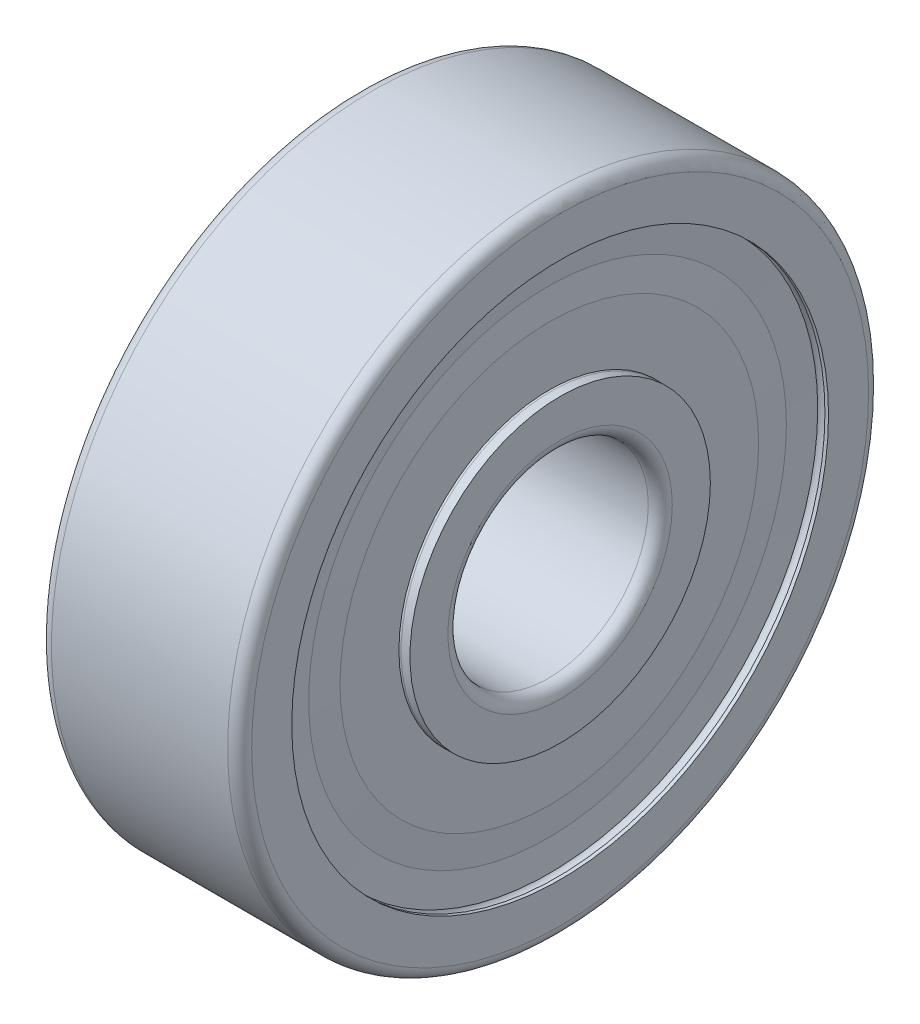
ISO-10303-21;
HEADER;
FILE_DESCRIPTION(('STEP AP214'),'2;1');
FILE_NAME('part.step','',(''),(''),'','','');
FILE_SCHEMA(('AUTOMOTIVE_DESIGN { 1 0 10303 214 1 1 1 1 }'));
ENDSEC;
DATA;
#1=APPLICATION_CONTEXT('core data for automotive mechanical design processes');
#2=APPLICATION_PROTOCOL_DEFINITION('international standard','automotive_design',2000,#1);
#3=PRODUCT_CONTEXT('',#1,'mechanical');
#4=PRODUCT('Part','Part','',(#3));
#5=PRODUCT_RELATED_PRODUCT_CATEGORY('part','',(#4));
#6=PRODUCT_DEFINITION_FORMATION('','',#4);
#7=PRODUCT_DEFINITION_CONTEXT('part definition',#1,'design');
#8=PRODUCT_DEFINITION('design','',#6,#7);
#9=PRODUCT_DEFINITION_SHAPE('','',#8);
#10=(LENGTH_UNIT() NAMED_UNIT(*) SI_UNIT(.MILLI.,.METRE.));
#11=(NAMED_UNIT(*) PLANE_ANGLE_UNIT() SI_UNIT($,.RADIAN.));
#12=(NAMED_UNIT(*) SI_UNIT($,.STERADIAN.) SOLID_ANGLE_UNIT());
#13=UNCERTAINTY_MEASURE_WITH_UNIT(LENGTH_MEASURE(1.E-05),#10,'distance_accuracy_value','');
#14=(GEOMETRIC_REPRESENTATION_CONTEXT(3) GLOBAL_UNCERTAINTY_ASSIGNED_CONTEXT((#13)) GLOBAL_UNIT_ASSIGNED_CONTEXT((#10,
#11,#12)) REPRESENTATION_CONTEXT('',''));
#15=CARTESIAN_POINT('',(0.,0.,0.));
#16=DIRECTION('',(0.,0.,1.));
#17=DIRECTION('',(1.,0.,0.));
#18=AXIS2_PLACEMENT_3D('',#15,#16,#17);
#19=CARTESIAN_POINT('',(4.778,0.,0.));
#20=DIRECTION('',(1.,0.,0.));
#21=DIRECTION('',(0.,0.,-1.));
#22=AXIS2_PLACEMENT_3D('',#19,#20,#21);
#23=TOROIDAL_SURFACE('',#22,3.972,0.222);
#24=CARTESIAN_POINT('',(4.63691261158267,0.,0.));
#25=DIRECTION('',(-1.,0.,0.));
#26=DIRECTION('',(0.,0.,1.));
#27=AXIS2_PLACEMENT_3D('',#24,#25,#26);
#28=CIRCLE('',#27,3.80059886572842);
#29=CARTESIAN_POINT('',(4.63691261158267,0.,3.80059886572842));
#30=VERTEX_POINT('',#29);
#31=EDGE_CURVE('P0_E10',#30,#30,#28,.T.);
#32=ORIENTED_EDGE('',*,*,#31,.T.);
#33=EDGE_LOOP('',(#32));
#34=FACE_BOUND('',#33,.T.);
#35=CARTESIAN_POINT('',(4.556,0.,0.));
#36=DIRECTION('',(1.,0.,0.));
#37=DIRECTION('',(0.,0.,-1.));
#38=AXIS2_PLACEMENT_3D('',#35,#36,#37);
#39=CIRCLE('',#38,3.972);
#40=CARTESIAN_POINT('',(4.556,0.,-3.972));
#41=VERTEX_POINT('',#40);
#42=EDGE_CURVE('P0_E67',#41,#41,#39,.T.);
#43=ORIENTED_EDGE('',*,*,#42,.T.);
#44=EDGE_LOOP('',(#43));
#45=FACE_BOUND('',#44,.T.);
#46=ADVANCED_FACE('P0_F14',(#34,#45),#23,.F.);
#47=CARTESIAN_POINT('',(0.222,0.,0.));
#48=DIRECTION('',(1.,0.,0.));
#49=DIRECTION('',(0.,0.,-1.));
#50=AXIS2_PLACEMENT_3D('',#47,#48,#49);
#51=TOROIDAL_SURFACE('',#50,3.972,0.222);
#52=CARTESIAN_POINT('',(0.27,0.,0.));
#53=DIRECTION('',(1.,0.,0.));
#54=DIRECTION('',(0.,0.,-1.));
#55=AXIS2_PLACEMENT_3D('',#52,#53,#54);
#56=CIRCLE('',#55,3.75525129758174);
#57=CARTESIAN_POINT('',(0.27,0.,-3.75525129758174));
#58=VERTEX_POINT('',#57);
#59=EDGE_CURVE('P0_E25',#58,#58,#56,.F.);
#60=ORIENTED_EDGE('',*,*,#59,.T.);
#61=EDGE_LOOP('',(#60));
#62=FACE_BOUND('',#61,.T.);
#63=CARTESIAN_POINT('',(0.222,0.,0.));
#64=DIRECTION('',(1.,0.,0.));
#65=DIRECTION('',(0.,0.,-1.));
#66=AXIS2_PLACEMENT_3D('',#63,#64,#65);
#67=CIRCLE('',#66,3.75);
#68=CARTESIAN_POINT('',(0.222,0.,-3.75));
#69=VERTEX_POINT('',#68);
#70=EDGE_CURVE('P0_E61',#69,#69,#67,.T.);
#71=ORIENTED_EDGE('',*,*,#70,.T.);
#72=EDGE_LOOP('',(#71));
#73=FACE_BOUND('',#72,.T.);
#74=ADVANCED_FACE('P0_F135',(#62,#73),#51,.F.);
#75=CARTESIAN_POINT('',(0.,4.15,0.));
#76=DIRECTION('',(-1.,0.,0.));
#77=DIRECTION('',(0.,0.,1.));
#78=AXIS2_PLACEMENT_3D('',#75,#76,#77);
#79=PLANE('',#78);
#80=CARTESIAN_POINT('',(0.,0.,0.));
#81=DIRECTION('',(1.,0.,0.));
#82=DIRECTION('',(0.,0.,-1.));
#83=AXIS2_PLACEMENT_3D('',#80,#81,#82);
#84=CIRCLE('',#83,2.79985);
#85=CARTESIAN_POINT('',(0.,0.,-2.79985));
#86=VERTEX_POINT('',#85);
#87=EDGE_CURVE('P0_E40',#86,#86,#84,.T.);
#88=ORIENTED_EDGE('',*,*,#87,.T.);
#89=EDGE_LOOP('',(#88));
#90=FACE_BOUND('',#89,.T.);
#91=CARTESIAN_POINT('',(0.,0.,0.));
#92=DIRECTION('',(1.,0.,0.));
#93=DIRECTION('',(0.,0.,-1.));
#94=AXIS2_PLACEMENT_3D('',#91,#92,#93);
#95=CIRCLE('',#94,3.75);
#96=CARTESIAN_POINT('',(0.,0.,-3.75));
#97=VERTEX_POINT('',#96);
#98=EDGE_CURVE('P0_E58',#97,#97,#95,.T.);
#99=ORIENTED_EDGE('',*,*,#98,.F.);
#100=EDGE_LOOP('',(#99));
#101=FACE_BOUND('',#100,.T.);
#102=ADVANCED_FACE('P0_F16',(#90,#101),#79,.T.);
#103=CARTESIAN_POINT('',(5.,2.79985,0.));
#104=DIRECTION('',(1.,0.,0.));
#105=DIRECTION('',(0.,0.,-1.));
#106=AXIS2_PLACEMENT_3D('',#103,#104,#105);
#107=PLANE('',#106);
#108=CARTESIAN_POINT('',(5.,0.,0.));
#109=DIRECTION('',(1.,0.,0.));
#110=DIRECTION('',(0.,0.,-1.));
#111=AXIS2_PLACEMENT_3D('',#108,#109,#110);
#112=CIRCLE('',#111,3.75);
#113=CARTESIAN_POINT('',(5.,0.,-3.75));
#114=VERTEX_POINT('',#113);
#115=EDGE_CURVE('P0_E73',#114,#114,#112,.T.);
#116=ORIENTED_EDGE('',*,*,#115,.T.);
#117=EDGE_LOOP('',(#116));
#118=FACE_BOUND('',#117,.T.);
#119=CARTESIAN_POINT('',(5.,0.,0.));
#120=DIRECTION('',(1.,0.,0.));
#121=DIRECTION('',(0.,0.,-1.));
#122=AXIS2_PLACEMENT_3D('',#119,#120,#121);
#123=CIRCLE('',#122,2.79985);
#124=CARTESIAN_POINT('',(5.,0.,-2.79985));
#125=VERTEX_POINT('',#124);
#126=EDGE_CURVE('P0_E49',#125,#125,#123,.T.);
#127=ORIENTED_EDGE('',*,*,#126,.F.);
#128=EDGE_LOOP('',(#127));
#129=FACE_BOUND('',#128,.T.);
#130=ADVANCED_FACE('P0_F188',(#118,#129),#107,.T.);
#131=CARTESIAN_POINT('',(0.3,0.,0.));
#132=DIRECTION('',(1.,0.,0.));
#133=DIRECTION('',(0.,0.,-1.));
#134=AXIS2_PLACEMENT_3D('',#131,#132,#133);
#135=TOROIDAL_SURFACE('',#134,2.79985,0.3);
#136=CARTESIAN_POINT('',(0.3,0.,0.));
#137=DIRECTION('',(1.,0.,0.));
#138=DIRECTION('',(0.,0.,-1.));
#139=AXIS2_PLACEMENT_3D('',#136,#137,#138);
#140=CIRCLE('',#139,2.49985);
#141=CARTESIAN_POINT('',(0.3,0.,-2.49985));
#142=VERTEX_POINT('',#141);
#143=EDGE_CURVE('P0_E43',#142,#142,#140,.T.);
#144=ORIENTED_EDGE('',*,*,#143,.T.);
#145=EDGE_LOOP('',(#144));
#146=FACE_BOUND('',#145,.T.);
#147=ORIENTED_EDGE('',*,*,#87,.F.);
#148=EDGE_LOOP('',(#147));
#149=FACE_BOUND('',#148,.T.);
#150=ADVANCED_FACE('P0_F191',(#146,#149),#135,.T.);
#151=CARTESIAN_POINT('',(50.,0.,0.));
#152=DIRECTION('',(1.,0.,0.));
#153=DIRECTION('',(0.,0.,-1.));
#154=AXIS2_PLACEMENT_3D('',#151,#152,#153);
#155=CYLINDRICAL_SURFACE('',#154,2.49985);
#156=CARTESIAN_POINT('',(4.7,0.,0.));
#157=DIRECTION('',(1.,0.,0.));
#158=DIRECTION('',(0.,0.,-1.));
#159=AXIS2_PLACEMENT_3D('',#156,#157,#158);
#160=CIRCLE('',#159,2.49985);
#161=CARTESIAN_POINT('',(4.7,0.,-2.49985));
#162=VERTEX_POINT('',#161);
#163=EDGE_CURVE('P0_E46',#162,#162,#160,.T.);
#164=ORIENTED_EDGE('',*,*,#163,.T.);
#165=EDGE_LOOP('',(#164));
#166=FACE_BOUND('',#165,.T.);
#167=ORIENTED_EDGE('',*,*,#143,.F.);
#168=EDGE_LOOP('',(#167));
#169=FACE_BOUND('',#168,.T.);
#170=ADVANCED_FACE('P0_F195',(#166,#169),#155,.F.);
#171=CARTESIAN_POINT('',(4.7,0.,0.));
#172=DIRECTION('',(1.,0.,0.));
#173=DIRECTION('',(0.,0.,-1.));
#174=AXIS2_PLACEMENT_3D('',#171,#172,#173);
#175=TOROIDAL_SURFACE('',#174,2.79985,0.3);
#176=ORIENTED_EDGE('',*,*,#126,.T.);
#177=EDGE_LOOP('',(#176));
#178=FACE_BOUND('',#177,.T.);
#179=ORIENTED_EDGE('',*,*,#163,.F.);
#180=EDGE_LOOP('',(#179));
#181=FACE_BOUND('',#180,.T.);
#182=ADVANCED_FACE('P0_F174',(#178,#181),#175,.T.);
#183=CARTESIAN_POINT('',(50.,0.,0.));
#184=DIRECTION('',(1.,0.,0.));
#185=DIRECTION('',(0.,0.,-1.));
#186=AXIS2_PLACEMENT_3D('',#183,#184,#185);
#187=CYLINDRICAL_SURFACE('',#186,3.75);
#188=ORIENTED_EDGE('',*,*,#70,.F.);
#189=EDGE_LOOP('',(#188));
#190=FACE_BOUND('',#189,.T.);
#191=ORIENTED_EDGE('',*,*,#98,.T.);
#192=EDGE_LOOP('',(#191));
#193=FACE_BOUND('',#192,.T.);
#194=ADVANCED_FACE('P0_F170',(#190,#193),#187,.T.);
#195=CARTESIAN_POINT('',(0.444,0.,0.));
#196=DIRECTION('',(1.,0.,0.));
#197=DIRECTION('',(0.,0.,-1.));
#198=AXIS2_PLACEMENT_3D('',#195,#196,#197);
#199=CIRCLE('',#198,3.972);
#200=CARTESIAN_POINT('',(0.444,0.,-3.972));
#201=VERTEX_POINT('',#200);
#202=EDGE_CURVE('P0_E64',#201,#201,#199,.T.);
#203=ORIENTED_EDGE('',*,*,#202,.F.);
#204=EDGE_LOOP('',(#203));
#205=FACE_BOUND('',#204,.T.);
#206=CARTESIAN_POINT('',(0.363087388417327,0.,0.));
#207=DIRECTION('',(1.,0.,0.));
#208=DIRECTION('',(0.,0.,-1.));
#209=AXIS2_PLACEMENT_3D('',#206,#207,#208);
#210=CIRCLE('',#209,3.80059886572843);
#211=CARTESIAN_POINT('',(0.363087388417327,0.,-3.80059886572843));
#212=VERTEX_POINT('',#211);
#213=EDGE_CURVE('P0_E29',#212,#212,#210,.T.);
#214=ORIENTED_EDGE('',*,*,#213,.T.);
#215=EDGE_LOOP('',(#214));
#216=FACE_BOUND('',#215,.T.);
#217=ADVANCED_FACE('P0_F143',(#205,#216),#51,.F.);
#218=CARTESIAN_POINT('',(0.444,3.972,0.));
#219=DIRECTION('',(1.,0.,0.));
#220=DIRECTION('',(0.,0.,-1.));
#221=AXIS2_PLACEMENT_3D('',#218,#219,#220);
#222=PLANE('',#221);
#223=CARTESIAN_POINT('',(0.444,0.,0.));
#224=DIRECTION('',(1.,0.,0.));
#225=DIRECTION('',(0.,0.,-1.));
#226=AXIS2_PLACEMENT_3D('',#223,#224,#225);
#227=CIRCLE('',#226,4.25);
#228=CARTESIAN_POINT('',(0.444,0.,-4.25));
#229=VERTEX_POINT('',#228);
#230=EDGE_CURVE('P0_E37',#229,#229,#227,.F.);
#231=ORIENTED_EDGE('',*,*,#230,.T.);
#232=EDGE_LOOP('',(#231));
#233=FACE_BOUND('',#232,.T.);
#234=ORIENTED_EDGE('',*,*,#202,.T.);
#235=EDGE_LOOP('',(#234));
#236=FACE_BOUND('',#235,.T.);
#237=ADVANCED_FACE('P0_F157',(#233,#236),#222,.F.);
#238=CARTESIAN_POINT('',(4.556,5.931,0.));
#239=DIRECTION('',(-1.,0.,0.));
#240=DIRECTION('',(0.,0.,1.));
#241=AXIS2_PLACEMENT_3D('',#238,#239,#240);
#242=PLANE('',#241);
#243=ORIENTED_EDGE('',*,*,#42,.F.);
#244=EDGE_LOOP('',(#243));
#245=FACE_BOUND('',#244,.T.);
#246=CARTESIAN_POINT('',(4.556,0.,0.));
#247=DIRECTION('',(-1.,0.,0.));
#248=DIRECTION('',(0.,0.,1.));
#249=AXIS2_PLACEMENT_3D('',#246,#247,#248);
#250=CIRCLE('',#249,4.25);
#251=CARTESIAN_POINT('',(4.556,0.,4.25));
#252=VERTEX_POINT('',#251);
#253=EDGE_CURVE('P0_E34',#252,#252,#250,.F.);
#254=ORIENTED_EDGE('',*,*,#253,.T.);
#255=EDGE_LOOP('',(#254));
#256=FACE_BOUND('',#255,.T.);
#257=ADVANCED_FACE('P0_F149',(#245,#256),#242,.F.);
#258=CARTESIAN_POINT('',(4.778,0.,0.));
#259=DIRECTION('',(1.,0.,0.));
#260=DIRECTION('',(0.,0.,-1.));
#261=AXIS2_PLACEMENT_3D('',#258,#259,#260);
#262=CIRCLE('',#261,3.75);
#263=CARTESIAN_POINT('',(4.778,0.,-3.75));
#264=VERTEX_POINT('',#263);
#265=EDGE_CURVE('P0_E70',#264,#264,#262,.T.);
#266=ORIENTED_EDGE('',*,*,#265,.F.);
#267=EDGE_LOOP('',(#266));
#268=FACE_BOUND('',#267,.T.);
#269=CARTESIAN_POINT('',(4.73,0.,0.));
#270=DIRECTION('',(-1.,0.,0.));
#271=DIRECTION('',(0.,0.,1.));
#272=AXIS2_PLACEMENT_3D('',#269,#270,#271);
#273=CIRCLE('',#272,3.75525129758174);
#274=CARTESIAN_POINT('',(4.73,0.,3.75525129758174));
#275=VERTEX_POINT('',#274);
#276=EDGE_CURVE('P0_E21',#275,#275,#273,.F.);
#277=ORIENTED_EDGE('',*,*,#276,.T.);
#278=EDGE_LOOP('',(#277));
#279=FACE_BOUND('',#278,.T.);
#280=ADVANCED_FACE('P0_F137',(#268,#279),#23,.F.);
#281=CARTESIAN_POINT('',(50.,0.,0.));
#282=DIRECTION('',(1.,0.,0.));
#283=DIRECTION('',(0.,0.,-1.));
#284=AXIS2_PLACEMENT_3D('',#281,#282,#283);
#285=CYLINDRICAL_SURFACE('',#284,3.75);
#286=ORIENTED_EDGE('',*,*,#115,.F.);
#287=EDGE_LOOP('',(#286));
#288=FACE_BOUND('',#287,.T.);
#289=ORIENTED_EDGE('',*,*,#265,.T.);
#290=EDGE_LOOP('',(#289));
#291=FACE_BOUND('',#290,.T.);
#292=ADVANCED_FACE('P0_F148',(#288,#291),#285,.T.);
#293=CARTESIAN_POINT('',(50.,0.,0.));
#294=DIRECTION('',(1.,0.,0.));
#295=DIRECTION('',(0.,0.,-1.));
#296=AXIS2_PLACEMENT_3D('',#293,#294,#295);
#297=CYLINDRICAL_SURFACE('',#296,4.25);
#298=CARTESIAN_POINT('',(3.46401296671777,0.,0.));
#299=DIRECTION('',(1.,0.,0.));
#300=DIRECTION('',(0.,0.,-1.));
#301=AXIS2_PLACEMENT_3D('',#298,#299,#300);
#302=CIRCLE('',#301,4.25);
#303=CARTESIAN_POINT('',(3.46401296671777,0.,-4.25));
#304=VERTEX_POINT('',#303);
#305=EDGE_CURVE('P0_E52',#304,#304,#302,.T.);
#306=ORIENTED_EDGE('',*,*,#305,.T.);
#307=EDGE_LOOP('',(#306));
#308=FACE_BOUND('',#307,.T.);
#309=ORIENTED_EDGE('',*,*,#253,.F.);
#310=EDGE_LOOP('',(#309));
#311=FACE_BOUND('',#310,.T.);
#312=ADVANCED_FACE('P0_F155',(#308,#311),#297,.T.);
#313=CARTESIAN_POINT('',(2.5,0.,0.));
#314=DIRECTION('',(1.,0.,0.));
#315=DIRECTION('',(0.,0.,-1.));
#316=AXIS2_PLACEMENT_3D('',#313,#314,#315);
#317=TOROIDAL_SURFACE('',#316,5.25,1.389);
#318=ORIENTED_EDGE('',*,*,#305,.F.);
#319=EDGE_LOOP('',(#318));
#320=FACE_BOUND('',#319,.T.);
#321=CARTESIAN_POINT('',(1.53598703328222,0.,0.));
#322=DIRECTION('',(1.,0.,0.));
#323=DIRECTION('',(0.,0.,-1.));
#324=AXIS2_PLACEMENT_3D('',#321,#322,#323);
#325=CIRCLE('',#324,4.25);
#326=CARTESIAN_POINT('',(1.53598703328222,0.,-4.25));
#327=VERTEX_POINT('',#326);
#328=EDGE_CURVE('P0_E55',#327,#327,#325,.T.);
#329=ORIENTED_EDGE('',*,*,#328,.T.);
#330=EDGE_LOOP('',(#329));
#331=FACE_BOUND('',#330,.T.);
#332=ADVANCED_FACE('P0_F180',(#320,#331),#317,.F.);
#333=CARTESIAN_POINT('',(50.,0.,0.));
#334=DIRECTION('',(1.,0.,0.));
#335=DIRECTION('',(0.,0.,-1.));
#336=AXIS2_PLACEMENT_3D('',#333,#334,#335);
#337=CYLINDRICAL_SURFACE('',#336,4.25);
#338=ORIENTED_EDGE('',*,*,#230,.F.);
#339=EDGE_LOOP('',(#338));
#340=FACE_BOUND('',#339,.T.);
#341=ORIENTED_EDGE('',*,*,#328,.F.);
#342=EDGE_LOOP('',(#341));
#343=FACE_BOUND('',#342,.T.);
#344=ADVANCED_FACE('P0_F176',(#340,#343),#337,.T.);
#345=CARTESIAN_POINT('',(0.36,0.,0.));
#346=DIRECTION('',(1.,0.,0.));
#347=DIRECTION('',(0.,0.,-1.));
#348=AXIS2_PLACEMENT_3D('',#345,#346,#347);
#349=CONICAL_SURFACE('',#348,3.75,1.50985493235548);
#350=CARTESIAN_POINT('',(0.45,0.,0.));
#351=DIRECTION('',(1.,0.,0.));
#352=DIRECTION('',(0.,0.,-1.));
#353=AXIS2_PLACEMENT_3D('',#350,#351,#352);
#354=CIRCLE('',#353,5.225);
#355=CARTESIAN_POINT('',(0.45,0.,-5.225));
#356=VERTEX_POINT('',#355);
#357=EDGE_CURVE('P0_E85',#356,#356,#354,.T.);
#358=ORIENTED_EDGE('',*,*,#357,.T.);
#359=EDGE_LOOP('',(#358));
#360=FACE_BOUND('',#359,.T.);
#361=ORIENTED_EDGE('',*,*,#213,.F.);
#362=EDGE_LOOP('',(#361));
#363=FACE_BOUND('',#362,.T.);
#364=ADVANCED_FACE('P0_F179',(#360,#363),#349,.F.);
#365=CARTESIAN_POINT('',(50.,0.,0.));
#366=DIRECTION('',(1.,0.,0.));
#367=DIRECTION('',(0.,0.,-1.));
#368=AXIS2_PLACEMENT_3D('',#365,#366,#367);
#369=CYLINDRICAL_SURFACE('',#368,6.7);
#370=CARTESIAN_POINT('',(0.27,0.,0.));
#371=DIRECTION('',(1.,0.,0.));
#372=DIRECTION('',(0.,0.,-1.));
#373=AXIS2_PLACEMENT_3D('',#370,#371,#372);
#374=CIRCLE('',#373,6.7);
#375=CARTESIAN_POINT('',(0.27,0.,-6.7));
#376=VERTEX_POINT('',#375);
#377=EDGE_CURVE('P0_E76',#376,#376,#374,.T.);
#378=ORIENTED_EDGE('',*,*,#377,.T.);
#379=EDGE_LOOP('',(#378));
#380=FACE_BOUND('',#379,.T.);
#381=CARTESIAN_POINT('',(0.36,0.,0.));
#382=DIRECTION('',(1.,0.,0.));
#383=DIRECTION('',(0.,0.,-1.));
#384=AXIS2_PLACEMENT_3D('',#381,#382,#383);
#385=CIRCLE('',#384,6.7);
#386=CARTESIAN_POINT('',(0.36,0.,-6.7));
#387=VERTEX_POINT('',#386);
#388=EDGE_CURVE('P0_E91',#387,#387,#385,.T.);
#389=ORIENTED_EDGE('',*,*,#388,.F.);
#390=EDGE_LOOP('',(#389));
#391=FACE_BOUND('',#390,.T.);
#392=ADVANCED_FACE('P0_F299',(#380,#391),#369,.T.);
#393=CARTESIAN_POINT('',(0.27,0.,0.));
#394=DIRECTION('',(-1.,0.,0.));
#395=DIRECTION('',(0.,0.,1.));
#396=AXIS2_PLACEMENT_3D('',#393,#394,#395);
#397=CONICAL_SURFACE('',#396,6.7,1.50985493235548);
#398=CARTESIAN_POINT('',(0.315,0.,0.));
#399=DIRECTION('',(1.,0.,0.));
#400=DIRECTION('',(0.,0.,-1.));
#401=AXIS2_PLACEMENT_3D('',#398,#399,#400);
#402=CIRCLE('',#401,5.9625);
#403=CARTESIAN_POINT('',(0.315,0.,-5.9625));
#404=VERTEX_POINT('',#403);
#405=EDGE_CURVE('P0_E79',#404,#404,#402,.T.);
#406=ORIENTED_EDGE('',*,*,#405,.T.);
#407=EDGE_LOOP('',(#406));
#408=FACE_BOUND('',#407,.T.);
#409=ORIENTED_EDGE('',*,*,#377,.F.);
#410=EDGE_LOOP('',(#409));
#411=FACE_BOUND('',#410,.T.);
#412=ADVANCED_FACE('P0_F310',(#408,#411),#397,.F.);
#413=CARTESIAN_POINT('',(0.315,0.,0.));
#414=DIRECTION('',(1.,0.,0.));
#415=DIRECTION('',(0.,0.,-1.));
#416=AXIS2_PLACEMENT_3D('',#413,#414,#415);
#417=CONICAL_SURFACE('',#416,5.9625,1.50985493235548);
#418=CARTESIAN_POINT('',(0.27,0.,0.));
#419=DIRECTION('',(1.,0.,0.));
#420=DIRECTION('',(0.,0.,-1.));
#421=AXIS2_PLACEMENT_3D('',#418,#419,#420);
#422=CIRCLE('',#421,5.225);
#423=CARTESIAN_POINT('',(0.27,0.,-5.225));
#424=VERTEX_POINT('',#423);
#425=EDGE_CURVE('P0_E82',#424,#424,#422,.T.);
#426=ORIENTED_EDGE('',*,*,#425,.T.);
#427=EDGE_LOOP('',(#426));
#428=FACE_BOUND('',#427,.T.);
#429=ORIENTED_EDGE('',*,*,#405,.F.);
#430=EDGE_LOOP('',(#429));
#431=FACE_BOUND('',#430,.T.);
#432=ADVANCED_FACE('P0_F320',(#428,#431),#417,.T.);
#433=CARTESIAN_POINT('',(0.27,5.225,0.));
#434=DIRECTION('',(-1.,0.,0.));
#435=DIRECTION('',(0.,0.,1.));
#436=AXIS2_PLACEMENT_3D('',#433,#434,#435);
#437=PLANE('',#436);
#438=ORIENTED_EDGE('',*,*,#59,.F.);
#439=EDGE_LOOP('',(#438));
#440=FACE_BOUND('',#439,.T.);
#441=ORIENTED_EDGE('',*,*,#425,.F.);
#442=EDGE_LOOP('',(#441));
#443=FACE_BOUND('',#442,.T.);
#444=ADVANCED_FACE('P0_F330',(#440,#443),#437,.T.);
#445=CARTESIAN_POINT('',(0.45,5.225,0.));
#446=DIRECTION('',(1.,0.,0.));
#447=DIRECTION('',(0.,0.,-1.));
#448=AXIS2_PLACEMENT_3D('',#445,#446,#447);
#449=PLANE('',#448);
#450=CARTESIAN_POINT('',(0.45,0.,0.));
#451=DIRECTION('',(1.,0.,0.));
#452=DIRECTION('',(0.,0.,-1.));
#453=AXIS2_PLACEMENT_3D('',#450,#451,#452);
#454=CIRCLE('',#453,5.9625);
#455=CARTESIAN_POINT('',(0.45,0.,-5.9625));
#456=VERTEX_POINT('',#455);
#457=EDGE_CURVE('P0_E88',#456,#456,#454,.T.);
#458=ORIENTED_EDGE('',*,*,#457,.T.);
#459=EDGE_LOOP('',(#458));
#460=FACE_BOUND('',#459,.T.);
#461=ORIENTED_EDGE('',*,*,#357,.F.);
#462=EDGE_LOOP('',(#461));
#463=FACE_BOUND('',#462,.T.);
#464=ADVANCED_FACE('P0_F340',(#460,#463),#449,.T.);
#465=CARTESIAN_POINT('',(0.45,0.,0.));
#466=DIRECTION('',(-1.,0.,0.));
#467=DIRECTION('',(0.,0.,1.));
#468=AXIS2_PLACEMENT_3D('',#465,#466,#467);
#469=CONICAL_SURFACE('',#468,5.9625,1.4493628598292);
#470=ORIENTED_EDGE('',*,*,#388,.T.);
#471=EDGE_LOOP('',(#470));
#472=FACE_BOUND('',#471,.T.);
#473=ORIENTED_EDGE('',*,*,#457,.F.);
#474=EDGE_LOOP('',(#473));
#475=FACE_BOUND('',#474,.T.);
#476=ADVANCED_FACE('P0_F130',(#472,#475),#469,.T.);
#477=CARTESIAN_POINT('',(4.55,0.,0.));
#478=DIRECTION('',(-1.,0.,0.));
#479=DIRECTION('',(0.,0.,1.));
#480=AXIS2_PLACEMENT_3D('',#477,#478,#479);
#481=CONICAL_SURFACE('',#480,5.225,1.50985493235548);
#482=ORIENTED_EDGE('',*,*,#31,.F.);
#483=EDGE_LOOP('',(#482));
#484=FACE_BOUND('',#483,.T.);
#485=CARTESIAN_POINT('',(4.55,0.,0.));
#486=DIRECTION('',(1.,0.,0.));
#487=DIRECTION('',(0.,0.,-1.));
#488=AXIS2_PLACEMENT_3D('',#485,#486,#487);
#489=CIRCLE('',#488,5.225);
#490=CARTESIAN_POINT('',(4.55,0.,-5.225));
#491=VERTEX_POINT('',#490);
#492=EDGE_CURVE('P0_E97',#491,#491,#489,.T.);
#493=ORIENTED_EDGE('',*,*,#492,.F.);
#494=EDGE_LOOP('',(#493));
#495=FACE_BOUND('',#494,.T.);
#496=ADVANCED_FACE('P0_F119',(#484,#495),#481,.F.);
#497=CARTESIAN_POINT('',(4.64,0.,0.));
#498=DIRECTION('',(1.,0.,0.));
#499=DIRECTION('',(0.,0.,-1.));
#500=AXIS2_PLACEMENT_3D('',#497,#498,#499);
#501=CONICAL_SURFACE('',#500,6.7,1.4493628598292);
#502=CARTESIAN_POINT('',(4.55,0.,0.));
#503=DIRECTION('',(1.,0.,0.));
#504=DIRECTION('',(0.,0.,-1.));
#505=AXIS2_PLACEMENT_3D('',#502,#503,#504);
#506=CIRCLE('',#505,5.9625);
#507=CARTESIAN_POINT('',(4.55,0.,-5.9625));
#508=VERTEX_POINT('',#507);
#509=EDGE_CURVE('P0_E94',#508,#508,#506,.T.);
#510=ORIENTED_EDGE('',*,*,#509,.T.);
#511=EDGE_LOOP('',(#510));
#512=FACE_BOUND('',#511,.T.);
#513=CARTESIAN_POINT('',(4.64,0.,0.));
#514=DIRECTION('',(1.,0.,0.));
#515=DIRECTION('',(0.,0.,-1.));
#516=AXIS2_PLACEMENT_3D('',#513,#514,#515);
#517=CIRCLE('',#516,6.7);
#518=CARTESIAN_POINT('',(4.64,0.,-6.7));
#519=VERTEX_POINT('',#518);
#520=EDGE_CURVE('P0_E109',#519,#519,#517,.T.);
#521=ORIENTED_EDGE('',*,*,#520,.F.);
#522=EDGE_LOOP('',(#521));
#523=FACE_BOUND('',#522,.T.);
#524=ADVANCED_FACE('P0_F116',(#512,#523),#501,.T.);
#525=CARTESIAN_POINT('',(4.55,5.9625,0.));
#526=DIRECTION('',(-1.,0.,0.));
#527=DIRECTION('',(0.,0.,1.));
#528=AXIS2_PLACEMENT_3D('',#525,#526,#527);
#529=PLANE('',#528);
#530=ORIENTED_EDGE('',*,*,#492,.T.);
#531=EDGE_LOOP('',(#530));
#532=FACE_BOUND('',#531,.T.);
#533=ORIENTED_EDGE('',*,*,#509,.F.);
#534=EDGE_LOOP('',(#533));
#535=FACE_BOUND('',#534,.T.);
#536=ADVANCED_FACE('P0_F118',(#532,#535),#529,.T.);
#537=CARTESIAN_POINT('',(4.73,3.75,0.));
#538=DIRECTION('',(1.,0.,0.));
#539=DIRECTION('',(0.,0.,-1.));
#540=AXIS2_PLACEMENT_3D('',#537,#538,#539);
#541=PLANE('',#540);
#542=CARTESIAN_POINT('',(4.73,0.,0.));
#543=DIRECTION('',(1.,0.,0.));
#544=DIRECTION('',(0.,0.,-1.));
#545=AXIS2_PLACEMENT_3D('',#542,#543,#544);
#546=CIRCLE('',#545,5.225);
#547=CARTESIAN_POINT('',(4.73,0.,-5.225));
#548=VERTEX_POINT('',#547);
#549=EDGE_CURVE('P0_E100',#548,#548,#546,.T.);
#550=ORIENTED_EDGE('',*,*,#549,.T.);
#551=EDGE_LOOP('',(#550));
#552=FACE_BOUND('',#551,.T.);
#553=ORIENTED_EDGE('',*,*,#276,.F.);
#554=EDGE_LOOP('',(#553));
#555=FACE_BOUND('',#554,.T.);
#556=ADVANCED_FACE('P0_F127',(#552,#555),#541,.T.);
#557=CARTESIAN_POINT('',(4.73,0.,0.));
#558=DIRECTION('',(-1.,0.,0.));
#559=DIRECTION('',(0.,0.,1.));
#560=AXIS2_PLACEMENT_3D('',#557,#558,#559);
#561=CONICAL_SURFACE('',#560,5.225,1.50985493235549);
#562=CARTESIAN_POINT('',(4.685,0.,0.));
#563=DIRECTION('',(1.,0.,0.));
#564=DIRECTION('',(0.,0.,-1.));
#565=AXIS2_PLACEMENT_3D('',#562,#563,#564);
#566=CIRCLE('',#565,5.9625);
#567=CARTESIAN_POINT('',(4.685,0.,-5.9625));
#568=VERTEX_POINT('',#567);
#569=EDGE_CURVE('P0_E103',#568,#568,#566,.T.);
#570=ORIENTED_EDGE('',*,*,#569,.T.);
#571=EDGE_LOOP('',(#570));
#572=FACE_BOUND('',#571,.T.);
#573=ORIENTED_EDGE('',*,*,#549,.F.);
#574=EDGE_LOOP('',(#573));
#575=FACE_BOUND('',#574,.T.);
#576=ADVANCED_FACE('P0_F384',(#572,#575),#561,.T.);
#577=CARTESIAN_POINT('',(4.685,0.,0.));
#578=DIRECTION('',(1.,0.,0.));
#579=DIRECTION('',(0.,0.,-1.));
#580=AXIS2_PLACEMENT_3D('',#577,#578,#579);
#581=CONICAL_SURFACE('',#580,5.9625,1.50985493235549);
#582=CARTESIAN_POINT('',(4.73,0.,0.));
#583=DIRECTION('',(1.,0.,0.));
#584=DIRECTION('',(0.,0.,-1.));
#585=AXIS2_PLACEMENT_3D('',#582,#583,#584);
#586=CIRCLE('',#585,6.7);
#587=CARTESIAN_POINT('',(4.73,0.,-6.7));
#588=VERTEX_POINT('',#587);
#589=EDGE_CURVE('P0_E106',#588,#588,#586,.T.);
#590=ORIENTED_EDGE('',*,*,#589,.T.);
#591=EDGE_LOOP('',(#590));
#592=FACE_BOUND('',#591,.T.);
#593=ORIENTED_EDGE('',*,*,#569,.F.);
#594=EDGE_LOOP('',(#593));
#595=FACE_BOUND('',#594,.T.);
#596=ADVANCED_FACE('P0_F394',(#592,#595),#581,.F.);
#597=CARTESIAN_POINT('',(50.,0.,0.));
#598=DIRECTION('',(1.,0.,0.));
#599=DIRECTION('',(0.,0.,-1.));
#600=AXIS2_PLACEMENT_3D('',#597,#598,#599);
#601=CYLINDRICAL_SURFACE('',#600,6.7);
#602=ORIENTED_EDGE('',*,*,#520,.T.);
#603=EDGE_LOOP('',(#602));
#604=FACE_BOUND('',#603,.T.);
#605=ORIENTED_EDGE('',*,*,#589,.F.);
#606=EDGE_LOOP('',(#605));
#607=FACE_BOUND('',#606,.T.);
#608=ADVANCED_FACE('P0_F113',(#604,#607),#601,.T.);
#609=CLOSED_SHELL('',(#46,#74,#102,#130,#150,#170,#182,#194,#217,#237,#257,#280,#292,#312,#332,
#344,#364,#392,#412,#432,#444,#464,#476,#496,#524,#536,#556,#576,#596,#608));
#610=MANIFOLD_SOLID_BREP('P0_B1',#609);
#611=CARTESIAN_POINT('',(0.,7.7,0.));
#612=DIRECTION('',(-1.,0.,0.));
#613=DIRECTION('',(0.,0.,1.));
#614=AXIS2_PLACEMENT_3D('',#611,#612,#613);
#615=PLANE('',#614);
#616=CARTESIAN_POINT('',(0.,0.,0.));
#617=DIRECTION('',(1.,0.,0.));
#618=DIRECTION('',(0.,0.,-1.));
#619=AXIS2_PLACEMENT_3D('',#616,#617,#618);
#620=CIRCLE('',#619,6.7);
#621=CARTESIAN_POINT('',(0.,0.,-6.7));
#622=VERTEX_POINT('',#621);
#623=EDGE_CURVE('P1_E10',#622,#622,#620,.T.);
#624=ORIENTED_EDGE('',*,*,#623,.T.);
#625=EDGE_LOOP('',(#624));
#626=FACE_BOUND('',#625,.T.);
#627=CARTESIAN_POINT('',(0.,0.,0.));
#628=DIRECTION('',(1.,0.,0.));
#629=DIRECTION('',(0.,0.,-1.));
#630=AXIS2_PLACEMENT_3D('',#627,#628,#629);
#631=CIRCLE('',#630,7.7);
#632=CARTESIAN_POINT('',(0.,0.,-7.7));
#633=VERTEX_POINT('',#632);
#634=EDGE_CURVE('P1_E60',#633,#633,#631,.T.);
#635=ORIENTED_EDGE('',*,*,#634,.F.);
#636=EDGE_LOOP('',(#635));
#637=FACE_BOUND('',#636,.T.);
#638=ADVANCED_FACE('P1_F14',(#626,#637),#615,.T.);
#639=CARTESIAN_POINT('',(50.,0.,0.));
#640=DIRECTION('',(1.,0.,0.));
#641=DIRECTION('',(0.,0.,-1.));
#642=AXIS2_PLACEMENT_3D('',#639,#640,#641);
#643=CYLINDRICAL_SURFACE('',#642,6.7);
#644=CARTESIAN_POINT('',(0.09,0.,0.));
#645=DIRECTION('',(1.,0.,0.));
#646=DIRECTION('',(0.,0.,-1.));
#647=AXIS2_PLACEMENT_3D('',#644,#645,#646);
#648=CIRCLE('',#647,6.7);
#649=CARTESIAN_POINT('',(0.09,0.,-6.7));
#650=VERTEX_POINT('',#649);
#651=EDGE_CURVE('P1_E20',#650,#650,#648,.T.);
#652=ORIENTED_EDGE('',*,*,#651,.T.);
#653=EDGE_LOOP('',(#652));
#654=FACE_BOUND('',#653,.T.);
#655=ORIENTED_EDGE('',*,*,#623,.F.);
#656=EDGE_LOOP('',(#655));
#657=FACE_BOUND('',#656,.T.);
#658=ADVANCED_FACE('P1_F68',(#654,#657),#643,.F.);
#659=CARTESIAN_POINT('',(0.27,0.,0.));
#660=DIRECTION('',(1.,0.,0.));
#661=DIRECTION('',(0.,0.,-1.));
#662=AXIS2_PLACEMENT_3D('',#659,#660,#661);
#663=TOROIDAL_SURFACE('',#662,6.7,0.18);
#664=ORIENTED_EDGE('',*,*,#651,.F.);
#665=EDGE_LOOP('',(#664));
#666=FACE_BOUND('',#665,.T.);
#667=CARTESIAN_POINT('',(0.45,0.,0.));
#668=DIRECTION('',(1.,0.,0.));
#669=DIRECTION('',(0.,0.,-1.));
#670=AXIS2_PLACEMENT_3D('',#667,#668,#669);
#671=CIRCLE('',#670,6.7);
#672=CARTESIAN_POINT('',(0.45,0.,-6.7));
#673=VERTEX_POINT('',#672);
#674=EDGE_CURVE('P1_E24',#673,#673,#671,.T.);
#675=ORIENTED_EDGE('',*,*,#674,.T.);
#676=EDGE_LOOP('',(#675));
#677=FACE_BOUND('',#676,.T.);
#678=ADVANCED_FACE('P1_F73',(#666,#677),#663,.F.);
#679=CARTESIAN_POINT('',(0.45,0.,0.));
#680=DIRECTION('',(-1.,0.,0.));
#681=DIRECTION('',(0.,0.,1.));
#682=AXIS2_PLACEMENT_3D('',#679,#680,#681);
#683=CONICAL_SURFACE('',#682,6.7,1.39626340159547);
#684=CARTESIAN_POINT('',(0.541513702987689,0.,0.));
#685=DIRECTION('',(1.,0.,0.));
#686=DIRECTION('',(0.,0.,-1.));
#687=AXIS2_PLACEMENT_3D('',#684,#685,#686);
#688=CIRCLE('',#687,6.181);
#689=CARTESIAN_POINT('',(0.541513702987689,0.,-6.181));
#690=VERTEX_POINT('',#689);
#691=EDGE_CURVE('P1_E28',#690,#690,#688,.T.);
#692=ORIENTED_EDGE('',*,*,#691,.T.);
#693=EDGE_LOOP('',(#692));
#694=FACE_BOUND('',#693,.T.);
#695=ORIENTED_EDGE('',*,*,#674,.F.);
#696=EDGE_LOOP('',(#695));
#697=FACE_BOUND('',#696,.T.);
#698=ADVANCED_FACE('P1_F77',(#694,#697),#683,.F.);
#699=CARTESIAN_POINT('',(50.,0.,0.));
#700=DIRECTION('',(1.,0.,0.));
#701=DIRECTION('',(0.,0.,-1.));
#702=AXIS2_PLACEMENT_3D('',#699,#700,#701);
#703=CYLINDRICAL_SURFACE('',#702,6.181);
#704=CARTESIAN_POINT('',(1.46919448973146,0.,0.));
#705=DIRECTION('',(1.,0.,0.));
#706=DIRECTION('',(0.,0.,-1.));
#707=AXIS2_PLACEMENT_3D('',#704,#705,#706);
#708=CIRCLE('',#707,6.181);
#709=CARTESIAN_POINT('',(1.46919448973146,0.,-6.181));
#710=VERTEX_POINT('',#709);
#711=EDGE_CURVE('P1_E33',#710,#710,#708,.T.);
#712=ORIENTED_EDGE('',*,*,#711,.T.);
#713=EDGE_LOOP('',(#712));
#714=FACE_BOUND('',#713,.T.);
#715=ORIENTED_EDGE('',*,*,#691,.F.);
#716=EDGE_LOOP('',(#715));
#717=FACE_BOUND('',#716,.T.);
#718=ADVANCED_FACE('P1_F84',(#714,#717),#703,.F.);
#719=CARTESIAN_POINT('',(2.5,0.,0.));
#720=DIRECTION('',(1.,0.,0.));
#721=DIRECTION('',(0.,0.,-1.));
#722=AXIS2_PLACEMENT_3D('',#719,#720,#721);
#723=TOROIDAL_SURFACE('',#722,5.25,1.389);
#724=ORIENTED_EDGE('',*,*,#711,.F.);
#725=EDGE_LOOP('',(#724));
#726=FACE_BOUND('',#725,.T.);
#727=CARTESIAN_POINT('',(3.53080551026855,0.,0.));
#728=DIRECTION('',(1.,0.,0.));
#729=DIRECTION('',(0.,0.,-1.));
#730=AXIS2_PLACEMENT_3D('',#727,#728,#729);
#731=CIRCLE('',#730,6.181);
#732=CARTESIAN_POINT('',(3.53080551026855,0.,-6.181));
#733=VERTEX_POINT('',#732);
#734=EDGE_CURVE('P1_E36',#733,#733,#731,.T.);
#735=ORIENTED_EDGE('',*,*,#734,.T.);
#736=EDGE_LOOP('',(#735));
#737=FACE_BOUND('',#736,.T.);
#738=ADVANCED_FACE('P1_F88',(#726,#737),#723,.F.);
#739=CARTESIAN_POINT('',(50.,0.,0.));
#740=DIRECTION('',(1.,0.,0.));
#741=DIRECTION('',(0.,0.,-1.));
#742=AXIS2_PLACEMENT_3D('',#739,#740,#741);
#743=CYLINDRICAL_SURFACE('',#742,6.181);
#744=CARTESIAN_POINT('',(4.45848629701231,0.,0.));
#745=DIRECTION('',(1.,0.,0.));
#746=DIRECTION('',(0.,0.,-1.));
#747=AXIS2_PLACEMENT_3D('',#744,#745,#746);
#748=CIRCLE('',#747,6.181);
#749=CARTESIAN_POINT('',(4.45848629701231,0.,-6.181));
#750=VERTEX_POINT('',#749);
#751=EDGE_CURVE('P1_E39',#750,#750,#748,.T.);
#752=ORIENTED_EDGE('',*,*,#751,.T.);
#753=EDGE_LOOP('',(#752));
#754=FACE_BOUND('',#753,.T.);
#755=ORIENTED_EDGE('',*,*,#734,.F.);
#756=EDGE_LOOP('',(#755));
#757=FACE_BOUND('',#756,.T.);
#758=ADVANCED_FACE('P1_F92',(#754,#757),#743,.F.);
#759=CARTESIAN_POINT('',(4.45848629701231,0.,0.));
#760=DIRECTION('',(1.,0.,0.));
#761=DIRECTION('',(0.,0.,-1.));
#762=AXIS2_PLACEMENT_3D('',#759,#760,#761);
#763=CONICAL_SURFACE('',#762,6.181,1.39626340159547);
#764=CARTESIAN_POINT('',(4.55,0.,0.));
#765=DIRECTION('',(1.,0.,0.));
#766=DIRECTION('',(0.,0.,-1.));
#767=AXIS2_PLACEMENT_3D('',#764,#765,#766);
#768=CIRCLE('',#767,6.7);
#769=CARTESIAN_POINT('',(4.55,0.,-6.7));
#770=VERTEX_POINT('',#769);
#771=EDGE_CURVE('P1_E42',#770,#770,#768,.T.);
#772=ORIENTED_EDGE('',*,*,#771,.T.);
#773=EDGE_LOOP('',(#772));
#774=FACE_BOUND('',#773,.T.);
#775=ORIENTED_EDGE('',*,*,#751,.F.);
#776=EDGE_LOOP('',(#775));
#777=FACE_BOUND('',#776,.T.);
#778=ADVANCED_FACE('P1_F96',(#774,#777),#763,.F.);
#779=CARTESIAN_POINT('',(4.73,0.,0.));
#780=DIRECTION('',(1.,0.,0.));
#781=DIRECTION('',(0.,0.,-1.));
#782=AXIS2_PLACEMENT_3D('',#779,#780,#781);
#783=TOROIDAL_SURFACE('',#782,6.70000000949766,0.18);
#784=ORIENTED_EDGE('',*,*,#771,.F.);
#785=EDGE_LOOP('',(#784));
#786=FACE_BOUND('',#785,.T.);
#787=CARTESIAN_POINT('',(4.91,0.,0.));
#788=DIRECTION('',(1.,0.,0.));
#789=DIRECTION('',(0.,0.,-1.));
#790=AXIS2_PLACEMENT_3D('',#787,#788,#789);
#791=CIRCLE('',#790,6.7);
#792=CARTESIAN_POINT('',(4.91,0.,-6.7));
#793=VERTEX_POINT('',#792);
#794=EDGE_CURVE('P1_E45',#793,#793,#791,.T.);
#795=ORIENTED_EDGE('',*,*,#794,.T.);
#796=EDGE_LOOP('',(#795));
#797=FACE_BOUND('',#796,.T.);
#798=ADVANCED_FACE('P1_F100',(#786,#797),#783,.F.);
#799=CARTESIAN_POINT('',(50.,0.,0.));
#800=DIRECTION('',(1.,0.,0.));
#801=DIRECTION('',(0.,0.,-1.));
#802=AXIS2_PLACEMENT_3D('',#799,#800,#801);
#803=CYLINDRICAL_SURFACE('',#802,6.7);
#804=CARTESIAN_POINT('',(5.,0.,0.));
#805=DIRECTION('',(1.,0.,0.));
#806=DIRECTION('',(0.,0.,-1.));
#807=AXIS2_PLACEMENT_3D('',#804,#805,#806);
#808=CIRCLE('',#807,6.7);
#809=CARTESIAN_POINT('',(5.,0.,-6.7));
#810=VERTEX_POINT('',#809);
#811=EDGE_CURVE('P1_E48',#810,#810,#808,.T.);
#812=ORIENTED_EDGE('',*,*,#811,.T.);
#813=EDGE_LOOP('',(#812));
#814=FACE_BOUND('',#813,.T.);
#815=ORIENTED_EDGE('',*,*,#794,.F.);
#816=EDGE_LOOP('',(#815));
#817=FACE_BOUND('',#816,.T.);
#818=ADVANCED_FACE('P1_F104',(#814,#817),#803,.F.);
#819=CARTESIAN_POINT('',(5.,6.7,0.));
#820=DIRECTION('',(1.,0.,0.));
#821=DIRECTION('',(0.,0.,-1.));
#822=AXIS2_PLACEMENT_3D('',#819,#820,#821);
#823=PLANE('',#822);
#824=CARTESIAN_POINT('',(5.,0.,0.));
#825=DIRECTION('',(1.,0.,0.));
#826=DIRECTION('',(0.,0.,-1.));
#827=AXIS2_PLACEMENT_3D('',#824,#825,#826);
#828=CIRCLE('',#827,7.7);
#829=CARTESIAN_POINT('',(5.,0.,-7.7));
#830=VERTEX_POINT('',#829);
#831=EDGE_CURVE('P1_E51',#830,#830,#828,.T.);
#832=ORIENTED_EDGE('',*,*,#831,.T.);
#833=EDGE_LOOP('',(#832));
#834=FACE_BOUND('',#833,.T.);
#835=ORIENTED_EDGE('',*,*,#811,.F.);
#836=EDGE_LOOP('',(#835));
#837=FACE_BOUND('',#836,.T.);
#838=ADVANCED_FACE('P1_F108',(#834,#837),#823,.T.);
#839=CARTESIAN_POINT('',(4.7,0.,0.));
#840=DIRECTION('',(1.,0.,0.));
#841=DIRECTION('',(0.,0.,-1.));
#842=AXIS2_PLACEMENT_3D('',#839,#840,#841);
#843=TOROIDAL_SURFACE('',#842,7.7,0.300000000000003);
#844=CARTESIAN_POINT('',(4.7,0.,0.));
#845=DIRECTION('',(1.,0.,0.));
#846=DIRECTION('',(0.,0.,-1.));
#847=AXIS2_PLACEMENT_3D('',#844,#845,#846);
#848=CIRCLE('',#847,8.);
#849=CARTESIAN_POINT('',(4.7,0.,-8.));
#850=VERTEX_POINT('',#849);
#851=EDGE_CURVE('P1_E54',#850,#850,#848,.T.);
#852=ORIENTED_EDGE('',*,*,#851,.T.);
#853=EDGE_LOOP('',(#852));
#854=FACE_BOUND('',#853,.T.);
#855=ORIENTED_EDGE('',*,*,#831,.F.);
#856=EDGE_LOOP('',(#855));
#857=FACE_BOUND('',#856,.T.);
#858=ADVANCED_FACE('P1_F112',(#854,#857),#843,.T.);
#859=CARTESIAN_POINT('',(50.,0.,0.));
#860=DIRECTION('',(1.,0.,0.));
#861=DIRECTION('',(0.,0.,-1.));
#862=AXIS2_PLACEMENT_3D('',#859,#860,#861);
#863=CYLINDRICAL_SURFACE('',#862,8.);
#864=CARTESIAN_POINT('',(0.3,0.,0.));
#865=DIRECTION('',(1.,0.,0.));
#866=DIRECTION('',(0.,0.,-1.));
#867=AXIS2_PLACEMENT_3D('',#864,#865,#866);
#868=CIRCLE('',#867,8.);
#869=CARTESIAN_POINT('',(0.3,0.,-8.));
#870=VERTEX_POINT('',#869);
#871=EDGE_CURVE('P1_E57',#870,#870,#868,.T.);
#872=ORIENTED_EDGE('',*,*,#871,.T.);
#873=EDGE_LOOP('',(#872));
#874=FACE_BOUND('',#873,.T.);
#875=ORIENTED_EDGE('',*,*,#851,.F.);
#876=EDGE_LOOP('',(#875));
#877=FACE_BOUND('',#876,.T.);
#878=ADVANCED_FACE('P1_F116',(#874,#877),#863,.T.);
#879=CARTESIAN_POINT('',(0.3,0.,0.));
#880=DIRECTION('',(1.,0.,0.));
#881=DIRECTION('',(0.,0.,-1.));
#882=AXIS2_PLACEMENT_3D('',#879,#880,#881);
#883=TOROIDAL_SURFACE('',#882,7.7,0.3);
#884=ORIENTED_EDGE('',*,*,#634,.T.);
#885=EDGE_LOOP('',(#884));
#886=FACE_BOUND('',#885,.T.);
#887=ORIENTED_EDGE('',*,*,#871,.F.);
#888=EDGE_LOOP('',(#887));
#889=FACE_BOUND('',#888,.T.);
#890=ADVANCED_FACE('P1_F64',(#886,#889),#883,.T.);
#891=CLOSED_SHELL('',(#638,#658,#678,#698,#718,#738,#758,#778,#798,#818,#838,#858,#878,#890));
#892=MANIFOLD_SOLID_BREP('P1_B1',#891);
#893=CARTESIAN_POINT('',(2.5,-1.16823490327065,-5.11837153895457));
#894=DIRECTION('',(1.,0.,0.));
#895=DIRECTION('',(0.,0.222520933956314,0.974927912181824));
#896=AXIS2_PLACEMENT_3D('',#893,#894,#895);
#897=SPHERICAL_SURFACE('',#896,1.389);
#898=CARTESIAN_POINT('',(3.889,-1.16823490327065,-5.11837153895457));
#899=VERTEX_POINT('',#898);
#900=VERTEX_LOOP('',#899);
#901=FACE_BOUND('',#900,.T.);
#902=ADVANCED_FACE('P2_F12',(#901),#897,.T.);
#903=CLOSED_SHELL('',(#902));
#904=MANIFOLD_SOLID_BREP('P2_B1',#903);
#905=CARTESIAN_POINT('',(2.5,3.27332145975835,-4.10461528295716));
#906=DIRECTION('',(1.,0.,0.));
#907=DIRECTION('',(0.,-0.623489801858734,0.78183148246803));
#908=AXIS2_PLACEMENT_3D('',#905,#906,#907);
#909=SPHERICAL_SURFACE('',#908,1.389);
#910=CARTESIAN_POINT('',(3.889,3.27332145975835,-4.10461528295716));
#911=VERTEX_POINT('',#910);
#912=VERTEX_LOOP('',#911);
#913=FACE_BOUND('',#912,.T.);
#914=ADVANCED_FACE('P3_F12',(#913),#909,.T.);
#915=CLOSED_SHELL('',(#914));
#916=MANIFOLD_SOLID_BREP('P3_B1',#915);
#917=CARTESIAN_POINT('',(2.5,-1.16823490327065,5.11837153895458));
#918=DIRECTION('',(1.,0.,0.));
#919=DIRECTION('',(0.,0.222520933956314,-0.974927912181824));
#920=AXIS2_PLACEMENT_3D('',#917,#918,#919);
#921=SPHERICAL_SURFACE('',#920,1.389);
#922=CARTESIAN_POINT('',(3.889,-1.16823490327065,5.11837153895458));
#923=VERTEX_POINT('',#922);
#924=VERTEX_LOOP('',#923);
#925=FACE_BOUND('',#924,.T.);
#926=ADVANCED_FACE('P4_F12',(#925),#921,.T.);
#927=CLOSED_SHELL('',(#926));
#928=MANIFOLD_SOLID_BREP('P4_B1',#927);
#929=CARTESIAN_POINT('',(2.5,5.25,0.));
#930=DIRECTION('',(1.,0.,0.));
#931=DIRECTION('',(0.,-1.,0.));
#932=AXIS2_PLACEMENT_3D('',#929,#930,#931);
#933=SPHERICAL_SURFACE('',#932,1.389);
#934=CARTESIAN_POINT('',(3.889,5.25,0.));
#935=VERTEX_POINT('',#934);
#936=VERTEX_LOOP('',#935);
#937=FACE_BOUND('',#936,.T.);
#938=ADVANCED_FACE('P5_F12',(#937),#933,.T.);
#939=CLOSED_SHELL('',(#938));
#940=MANIFOLD_SOLID_BREP('P5_B1',#939);
#941=CARTESIAN_POINT('',(2.5,3.27332145975835,4.10461528295716));
#942=DIRECTION('',(1.,0.,0.));
#943=DIRECTION('',(0.,-0.623489801858733,-0.78183148246803));
#944=AXIS2_PLACEMENT_3D('',#941,#942,#943);
#945=SPHERICAL_SURFACE('',#944,1.389);
#946=CARTESIAN_POINT('',(3.889,3.27332145975835,4.10461528295716));
#947=VERTEX_POINT('',#946);
#948=VERTEX_LOOP('',#947);
#949=FACE_BOUND('',#948,.T.);
#950=ADVANCED_FACE('P6_F12',(#949),#945,.T.);
#951=CLOSED_SHELL('',(#950));
#952=MANIFOLD_SOLID_BREP('P6_B1',#951);
#953=CARTESIAN_POINT('',(2.5,-4.7300865564877,2.27788963036718));
#954=DIRECTION('',(1.,0.,0.));
#955=DIRECTION('',(0.,0.900968867902419,-0.433883739117558));
#956=AXIS2_PLACEMENT_3D('',#953,#954,#955);
#957=SPHERICAL_SURFACE('',#956,1.389);
#958=CARTESIAN_POINT('',(3.889,-4.7300865564877,2.27788963036718));
#959=VERTEX_POINT('',#958);
#960=VERTEX_LOOP('',#959);
#961=FACE_BOUND('',#960,.T.);
#962=ADVANCED_FACE('P7_F12',(#961),#957,.T.);
#963=CLOSED_SHELL('',(#962));
#964=MANIFOLD_SOLID_BREP('P7_B1',#963);
#965=CARTESIAN_POINT('',(2.5,-4.7300865564877,-2.27788963036718));
#966=DIRECTION('',(1.,0.,0.));
#967=DIRECTION('',(0.,0.900968867902419,0.433883739117559));
#968=AXIS2_PLACEMENT_3D('',#965,#966,#967);
#969=SPHERICAL_SURFACE('',#968,1.389);
#970=CARTESIAN_POINT('',(3.889,-4.7300865564877,-2.27788963036718));
#971=VERTEX_POINT('',#970);
#972=VERTEX_LOOP('',#971);
#973=FACE_BOUND('',#972,.T.);
#974=ADVANCED_FACE('P8_F12',(#973),#969,.T.);
#975=CLOSED_SHELL('',(#974));
#976=MANIFOLD_SOLID_BREP('P8_B1',#975);
#977=ADVANCED_BREP_SHAPE_REPRESENTATION('',(#18,#610,#892,#904,#916,#928,#940,#952,#964,#976),#14);
#978=SHAPE_DEFINITION_REPRESENTATION(#9,#977);
ENDSEC;
END-ISO-10303-21;
